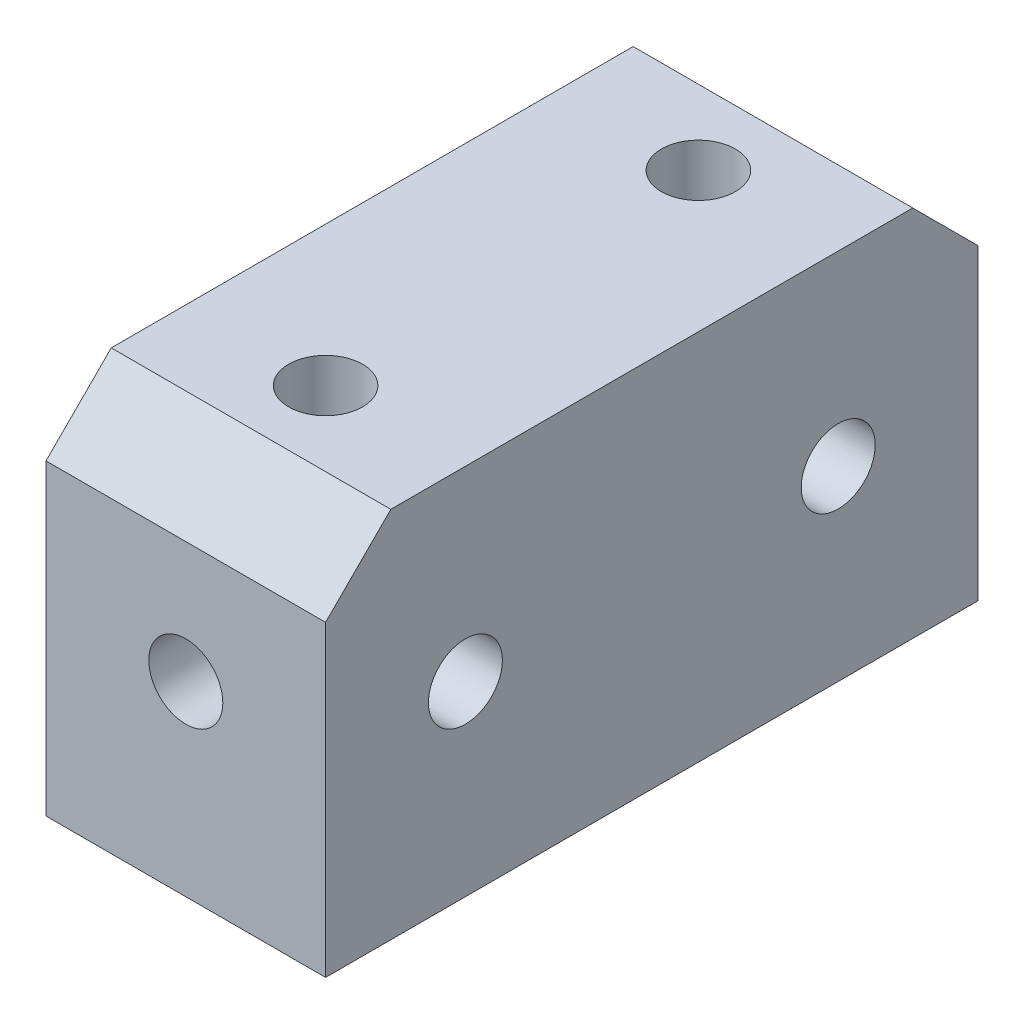
ISO-10303-21;
HEADER;
FILE_DESCRIPTION(('STEP AP214'),'2;1');
FILE_NAME('part.step','',(''),(''),'','','');
FILE_SCHEMA(('AUTOMOTIVE_DESIGN { 1 0 10303 214 1 1 1 1 }'));
ENDSEC;
DATA;
#1=APPLICATION_CONTEXT('core data for automotive mechanical design processes');
#2=APPLICATION_PROTOCOL_DEFINITION('international standard','automotive_design',2000,#1);
#3=PRODUCT_CONTEXT('',#1,'mechanical');
#4=PRODUCT('Part','Part','',(#3));
#5=PRODUCT_RELATED_PRODUCT_CATEGORY('part','',(#4));
#6=PRODUCT_DEFINITION_FORMATION('','',#4);
#7=PRODUCT_DEFINITION_CONTEXT('part definition',#1,'design');
#8=PRODUCT_DEFINITION('design','',#6,#7);
#9=PRODUCT_DEFINITION_SHAPE('','',#8);
#10=(LENGTH_UNIT() NAMED_UNIT(*) SI_UNIT(.MILLI.,.METRE.));
#11=(NAMED_UNIT(*) PLANE_ANGLE_UNIT() SI_UNIT($,.RADIAN.));
#12=(NAMED_UNIT(*) SI_UNIT($,.STERADIAN.) SOLID_ANGLE_UNIT());
#13=UNCERTAINTY_MEASURE_WITH_UNIT(LENGTH_MEASURE(1.E-05),#10,'distance_accuracy_value','');
#14=(GEOMETRIC_REPRESENTATION_CONTEXT(3) GLOBAL_UNCERTAINTY_ASSIGNED_CONTEXT((#13)) GLOBAL_UNIT_ASSIGNED_CONTEXT((#10,
#11,#12)) REPRESENTATION_CONTEXT('',''));
#15=CARTESIAN_POINT('',(0.,0.,0.));
#16=DIRECTION('',(0.,0.,1.));
#17=DIRECTION('',(1.,0.,0.));
#18=AXIS2_PLACEMENT_3D('',#15,#16,#17);
#19=CARTESIAN_POINT('',(15.,0.,0.));
#20=DIRECTION('',(-1.,0.,0.));
#21=DIRECTION('',(0.,0.,1.));
#22=AXIS2_PLACEMENT_3D('',#19,#20,#21);
#23=PLANE('',#22);
#24=DIRECTION('',(0.,1.,0.));
#25=VECTOR('',#24,1.);
#26=CARTESIAN_POINT('',(15.,20.,-35.));
#27=LINE('',#26,#25);
#28=CARTESIAN_POINT('',(15.,-20.,-35.));
#29=VERTEX_POINT('',#28);
#30=CARTESIAN_POINT('',(15.,13.,-35.));
#31=VERTEX_POINT('',#30);
#32=EDGE_CURVE('E151',#29,#31,#27,.T.);
#33=ORIENTED_EDGE('',*,*,#32,.T.);
#34=DIRECTION('',(0.,-0.707106781186549,-0.707106781186546));
#35=VECTOR('',#34,1.);
#36=CARTESIAN_POINT('',(15.,20.,-28.));
#37=LINE('',#36,#35);
#38=CARTESIAN_POINT('',(15.,20.,-28.));
#39=VERTEX_POINT('',#38);
#40=EDGE_CURVE('E46',#31,#39,#37,.F.);
#41=ORIENTED_EDGE('',*,*,#40,.T.);
#42=DIRECTION('',(0.,0.,1.));
#43=VECTOR('',#42,1.);
#44=CARTESIAN_POINT('',(15.,20.,-35.));
#45=LINE('',#44,#43);
#46=CARTESIAN_POINT('',(15.,20.,28.));
#47=VERTEX_POINT('',#46);
#48=EDGE_CURVE('E153',#39,#47,#45,.T.);
#49=ORIENTED_EDGE('',*,*,#48,.T.);
#50=DIRECTION('',(0.,0.707106781186546,-0.707106781186549));
#51=VECTOR('',#50,1.);
#52=CARTESIAN_POINT('',(15.,13.,35.));
#53=LINE('',#52,#51);
#54=CARTESIAN_POINT('',(15.,13.,35.));
#55=VERTEX_POINT('',#54);
#56=EDGE_CURVE('E53',#47,#55,#53,.F.);
#57=ORIENTED_EDGE('',*,*,#56,.T.);
#58=DIRECTION('',(0.,-1.,0.));
#59=VECTOR('',#58,1.);
#60=CARTESIAN_POINT('',(15.,20.,35.));
#61=LINE('',#60,#59);
#62=CARTESIAN_POINT('',(15.,-20.,35.));
#63=VERTEX_POINT('',#62);
#64=EDGE_CURVE('E146',#55,#63,#61,.T.);
#65=ORIENTED_EDGE('',*,*,#64,.T.);
#66=DIRECTION('',(0.,0.,-1.));
#67=VECTOR('',#66,1.);
#68=CARTESIAN_POINT('',(15.,-20.,-35.));
#69=LINE('',#68,#67);
#70=EDGE_CURVE('E148',#63,#29,#69,.T.);
#71=ORIENTED_EDGE('',*,*,#70,.T.);
#72=EDGE_LOOP('',(#33,#41,#49,#57,#65,#71));
#73=FACE_BOUND('',#72,.T.);
#74=CARTESIAN_POINT('',(15.,0.,20.));
#75=DIRECTION('',(1.,0.,0.));
#76=DIRECTION('',(0.,0.,-1.));
#77=AXIS2_PLACEMENT_3D('',#74,#75,#76);
#78=CIRCLE('',#77,3.97);
#79=CARTESIAN_POINT('',(15.,0.,16.03));
#80=VERTEX_POINT('',#79);
#81=EDGE_CURVE('E140',#80,#80,#78,.T.);
#82=ORIENTED_EDGE('',*,*,#81,.F.);
#83=EDGE_LOOP('',(#82));
#84=FACE_BOUND('',#83,.T.);
#85=CARTESIAN_POINT('',(15.,0.,-20.));
#86=DIRECTION('',(1.,0.,0.));
#87=DIRECTION('',(0.,0.,-1.));
#88=AXIS2_PLACEMENT_3D('',#85,#86,#87);
#89=CIRCLE('',#88,3.97);
#90=CARTESIAN_POINT('',(15.,0.,-23.97));
#91=VERTEX_POINT('',#90);
#92=EDGE_CURVE('E134',#91,#91,#89,.T.);
#93=ORIENTED_EDGE('',*,*,#92,.F.);
#94=EDGE_LOOP('',(#93));
#95=FACE_BOUND('',#94,.T.);
#96=ADVANCED_FACE('F38',(#73,#84,#95),#23,.F.);
#97=CARTESIAN_POINT('',(-15.,0.,0.));
#98=DIRECTION('',(-1.,0.,0.));
#99=DIRECTION('',(0.,0.,1.));
#100=AXIS2_PLACEMENT_3D('',#97,#98,#99);
#101=PLANE('',#100);
#102=CARTESIAN_POINT('',(-15.,0.,20.));
#103=DIRECTION('',(1.,0.,0.));
#104=DIRECTION('',(0.,0.,-1.));
#105=AXIS2_PLACEMENT_3D('',#102,#103,#104);
#106=CIRCLE('',#105,3.97);
#107=CARTESIAN_POINT('',(-15.,0.,16.03));
#108=VERTEX_POINT('',#107);
#109=EDGE_CURVE('E137',#108,#108,#106,.T.);
#110=ORIENTED_EDGE('',*,*,#109,.T.);
#111=EDGE_LOOP('',(#110));
#112=FACE_BOUND('',#111,.T.);
#113=DIRECTION('',(0.,0.,1.));
#114=VECTOR('',#113,1.);
#115=CARTESIAN_POINT('',(-15.,20.,-35.));
#116=LINE('',#115,#114);
#117=CARTESIAN_POINT('',(-15.,20.,-28.));
#118=VERTEX_POINT('',#117);
#119=CARTESIAN_POINT('',(-15.,20.,28.));
#120=VERTEX_POINT('',#119);
#121=EDGE_CURVE('E149',#118,#120,#116,.T.);
#122=ORIENTED_EDGE('',*,*,#121,.F.);
#123=DIRECTION('',(0.,0.707106781186549,0.707106781186546));
#124=VECTOR('',#123,1.);
#125=CARTESIAN_POINT('',(-15.,24.,-24.));
#126=LINE('',#125,#124);
#127=CARTESIAN_POINT('',(-15.,13.,-35.));
#128=VERTEX_POINT('',#127);
#129=EDGE_CURVE('E183',#118,#128,#126,.F.);
#130=ORIENTED_EDGE('',*,*,#129,.T.);
#131=DIRECTION('',(0.,1.,0.));
#132=VECTOR('',#131,1.);
#133=CARTESIAN_POINT('',(-15.,20.,-35.));
#134=LINE('',#133,#132);
#135=CARTESIAN_POINT('',(-15.,-20.,-35.));
#136=VERTEX_POINT('',#135);
#137=EDGE_CURVE('E159',#136,#128,#134,.T.);
#138=ORIENTED_EDGE('',*,*,#137,.F.);
#139=DIRECTION('',(0.,0.,-1.));
#140=VECTOR('',#139,1.);
#141=CARTESIAN_POINT('',(-15.,-20.,-35.));
#142=LINE('',#141,#140);
#143=CARTESIAN_POINT('',(-15.,-20.,35.));
#144=VERTEX_POINT('',#143);
#145=EDGE_CURVE('E157',#144,#136,#142,.T.);
#146=ORIENTED_EDGE('',*,*,#145,.F.);
#147=DIRECTION('',(0.,-1.,0.));
#148=VECTOR('',#147,1.);
#149=CARTESIAN_POINT('',(-15.,20.,35.));
#150=LINE('',#149,#148);
#151=CARTESIAN_POINT('',(-15.,13.,35.));
#152=VERTEX_POINT('',#151);
#153=EDGE_CURVE('E143',#152,#144,#150,.T.);
#154=ORIENTED_EDGE('',*,*,#153,.F.);
#155=DIRECTION('',(0.,-0.707106781186546,0.707106781186549));
#156=VECTOR('',#155,1.);
#157=CARTESIAN_POINT('',(-15.,24.,23.9999999999999));
#158=LINE('',#157,#156);
#159=EDGE_CURVE('E181',#152,#120,#158,.F.);
#160=ORIENTED_EDGE('',*,*,#159,.T.);
#161=EDGE_LOOP('',(#122,#130,#138,#146,#154,#160));
#162=FACE_BOUND('',#161,.T.);
#163=CARTESIAN_POINT('',(-15.,0.,-20.));
#164=DIRECTION('',(1.,0.,0.));
#165=DIRECTION('',(0.,0.,-1.));
#166=AXIS2_PLACEMENT_3D('',#163,#164,#165);
#167=CIRCLE('',#166,3.97);
#168=CARTESIAN_POINT('',(-15.,0.,-23.97));
#169=VERTEX_POINT('',#168);
#170=EDGE_CURVE('E130',#169,#169,#167,.T.);
#171=ORIENTED_EDGE('',*,*,#170,.T.);
#172=EDGE_LOOP('',(#171));
#173=FACE_BOUND('',#172,.T.);
#174=ADVANCED_FACE('F198',(#112,#162,#173),#101,.T.);
#175=CARTESIAN_POINT('',(15.,20.,35.));
#176=DIRECTION('',(0.,0.,-1.));
#177=DIRECTION('',(-1.,0.,0.));
#178=AXIS2_PLACEMENT_3D('',#175,#176,#177);
#179=PLANE('',#178);
#180=CARTESIAN_POINT('',(0.,0.,35.));
#181=DIRECTION('',(0.,0.,1.));
#182=DIRECTION('',(1.,0.,0.));
#183=AXIS2_PLACEMENT_3D('',#180,#181,#182);
#184=CIRCLE('',#183,3.97);
#185=CARTESIAN_POINT('',(3.97,0.,35.));
#186=VERTEX_POINT('',#185);
#187=EDGE_CURVE('E127',#186,#186,#184,.T.);
#188=ORIENTED_EDGE('',*,*,#187,.F.);
#189=EDGE_LOOP('',(#188));
#190=FACE_BOUND('',#189,.T.);
#191=ORIENTED_EDGE('',*,*,#64,.F.);
#192=DIRECTION('',(-1.,0.,0.));
#193=VECTOR('',#192,1.);
#194=CARTESIAN_POINT('',(15.,13.,35.));
#195=LINE('',#194,#193);
#196=EDGE_CURVE('E11',#55,#152,#195,.T.);
#197=ORIENTED_EDGE('',*,*,#196,.T.);
#198=ORIENTED_EDGE('',*,*,#153,.T.);
#199=DIRECTION('',(-1.,0.,0.));
#200=VECTOR('',#199,1.);
#201=CARTESIAN_POINT('',(15.,-20.,35.));
#202=LINE('',#201,#200);
#203=EDGE_CURVE('E165',#63,#144,#202,.T.);
#204=ORIENTED_EDGE('',*,*,#203,.F.);
#205=EDGE_LOOP('',(#191,#197,#198,#204));
#206=FACE_BOUND('',#205,.T.);
#207=ADVANCED_FACE('F209',(#190,#206),#179,.F.);
#208=CARTESIAN_POINT('',(15.,-20.,-35.));
#209=DIRECTION('',(0.,1.,0.));
#210=DIRECTION('',(0.,0.,1.));
#211=AXIS2_PLACEMENT_3D('',#208,#209,#210);
#212=PLANE('',#211);
#213=ORIENTED_EDGE('',*,*,#145,.T.);
#214=DIRECTION('',(-1.,0.,0.));
#215=VECTOR('',#214,1.);
#216=CARTESIAN_POINT('',(15.,-20.,-35.));
#217=LINE('',#216,#215);
#218=EDGE_CURVE('E155',#29,#136,#217,.T.);
#219=ORIENTED_EDGE('',*,*,#218,.F.);
#220=ORIENTED_EDGE('',*,*,#70,.F.);
#221=ORIENTED_EDGE('',*,*,#203,.T.);
#222=EDGE_LOOP('',(#213,#219,#220,#221));
#223=FACE_BOUND('',#222,.T.);
#224=ADVANCED_FACE('F205',(#223),#212,.F.);
#225=CARTESIAN_POINT('',(15.,20.,-35.));
#226=DIRECTION('',(0.,0.,1.));
#227=DIRECTION('',(0.,-1.,0.));
#228=AXIS2_PLACEMENT_3D('',#225,#226,#227);
#229=PLANE('',#228);
#230=ORIENTED_EDGE('',*,*,#137,.T.);
#231=DIRECTION('',(1.,0.,0.));
#232=VECTOR('',#231,1.);
#233=CARTESIAN_POINT('',(15.,13.,-35.));
#234=LINE('',#233,#232);
#235=EDGE_CURVE('E61',#128,#31,#234,.T.);
#236=ORIENTED_EDGE('',*,*,#235,.T.);
#237=ORIENTED_EDGE('',*,*,#32,.F.);
#238=ORIENTED_EDGE('',*,*,#218,.T.);
#239=EDGE_LOOP('',(#230,#236,#237,#238));
#240=FACE_BOUND('',#239,.T.);
#241=ADVANCED_FACE('F201',(#240),#229,.F.);
#242=CARTESIAN_POINT('',(15.,20.,-35.));
#243=DIRECTION('',(0.,-1.,0.));
#244=DIRECTION('',(0.,0.,-1.));
#245=AXIS2_PLACEMENT_3D('',#242,#243,#244);
#246=PLANE('',#245);
#247=CARTESIAN_POINT('',(0.,20.,-20.));
#248=DIRECTION('',(0.,1.,0.));
#249=DIRECTION('',(0.,0.,1.));
#250=AXIS2_PLACEMENT_3D('',#247,#248,#249);
#251=CIRCLE('',#250,3.97);
#252=CARTESIAN_POINT('',(0.,20.,-16.03));
#253=VERTEX_POINT('',#252);
#254=EDGE_CURVE('E121',#253,#253,#251,.T.);
#255=ORIENTED_EDGE('',*,*,#254,.F.);
#256=EDGE_LOOP('',(#255));
#257=FACE_BOUND('',#256,.T.);
#258=CARTESIAN_POINT('',(0.,20.,20.));
#259=DIRECTION('',(0.,1.,0.));
#260=DIRECTION('',(0.,0.,1.));
#261=AXIS2_PLACEMENT_3D('',#258,#259,#260);
#262=CIRCLE('',#261,3.97);
#263=CARTESIAN_POINT('',(0.,20.,23.97));
#264=VERTEX_POINT('',#263);
#265=EDGE_CURVE('E261',#264,#264,#262,.T.);
#266=ORIENTED_EDGE('',*,*,#265,.F.);
#267=EDGE_LOOP('',(#266));
#268=FACE_BOUND('',#267,.T.);
#269=ORIENTED_EDGE('',*,*,#48,.F.);
#270=DIRECTION('',(-1.,0.,0.));
#271=VECTOR('',#270,1.);
#272=CARTESIAN_POINT('',(15.,20.,-28.));
#273=LINE('',#272,#271);
#274=EDGE_CURVE('E178',#39,#118,#273,.T.);
#275=ORIENTED_EDGE('',*,*,#274,.T.);
#276=ORIENTED_EDGE('',*,*,#121,.T.);
#277=DIRECTION('',(1.,0.,0.));
#278=VECTOR('',#277,1.);
#279=CARTESIAN_POINT('',(15.,20.,28.));
#280=LINE('',#279,#278);
#281=EDGE_CURVE('E176',#120,#47,#280,.T.);
#282=ORIENTED_EDGE('',*,*,#281,.T.);
#283=EDGE_LOOP('',(#269,#275,#276,#282));
#284=FACE_BOUND('',#283,.T.);
#285=ADVANCED_FACE('F192',(#257,#268,#284),#246,.F.);
#286=CARTESIAN_POINT('',(15.,0.,20.));
#287=DIRECTION('',(-1.,0.,0.));
#288=DIRECTION('',(0.,0.,1.));
#289=AXIS2_PLACEMENT_3D('',#286,#287,#288);
#290=CYLINDRICAL_SURFACE('',#289,3.97);
#291=CARTESIAN_POINT('',(0.,0.,20.));
#292=DIRECTION('',(-0.707106781186547,0.707106781186547,0.));
#293=DIRECTION('',(-0.707106781186547,-0.707106781186547,0.));
#294=AXIS2_PLACEMENT_3D('',#291,#292,#293);
#295=ELLIPSE('',#294,5.61442784262119,3.97);
#296=CARTESIAN_POINT('',(0.,0.,16.03));
#297=VERTEX_POINT('',#296);
#298=CARTESIAN_POINT('',(2.80721392131059,2.80721392131059,22.8072139213106));
#299=VERTEX_POINT('',#298);
#300=EDGE_CURVE('E115',#297,#299,#295,.F.);
#301=ORIENTED_EDGE('',*,*,#300,.F.);
#302=CARTESIAN_POINT('',(0.,0.,20.));
#303=DIRECTION('',(-0.707106781186547,-0.707106781186547,0.));
#304=DIRECTION('',(-0.707106781186547,0.707106781186547,0.));
#305=AXIS2_PLACEMENT_3D('',#302,#303,#304);
#306=ELLIPSE('',#305,5.61442784262119,3.97);
#307=CARTESIAN_POINT('',(-2.8072139213106,2.80721392131059,22.8072139213106));
#308=VERTEX_POINT('',#307);
#309=EDGE_CURVE('E111',#308,#297,#306,.T.);
#310=ORIENTED_EDGE('',*,*,#309,.F.);
#311=CARTESIAN_POINT('',(0.,0.,20.));
#312=DIRECTION('',(-0.707106781186548,0.,-0.707106781186547));
#313=DIRECTION('',(-0.707106781186548,0.,0.707106781186547));
#314=AXIS2_PLACEMENT_3D('',#311,#312,#313);
#315=ELLIPSE('',#314,5.61442784262119,3.97);
#316=CARTESIAN_POINT('',(0.,-3.97,20.));
#317=VERTEX_POINT('',#316);
#318=EDGE_CURVE('E168',#317,#308,#315,.T.);
#319=ORIENTED_EDGE('',*,*,#318,.F.);
#320=CARTESIAN_POINT('',(0.,0.,20.));
#321=DIRECTION('',(-0.707106781186548,0.,0.707106781186547));
#322=DIRECTION('',(-0.707106781186548,0.,-0.707106781186547));
#323=AXIS2_PLACEMENT_3D('',#320,#321,#322);
#324=ELLIPSE('',#323,5.61442784262119,3.97);
#325=EDGE_CURVE('E126',#299,#317,#324,.F.);
#326=ORIENTED_EDGE('',*,*,#325,.F.);
#327=EDGE_LOOP('',(#301,#310,#319,#326));
#328=FACE_BOUND('',#327,.T.);
#329=ORIENTED_EDGE('',*,*,#81,.T.);
#330=EDGE_LOOP('',(#329));
#331=FACE_BOUND('',#330,.T.);
#332=ORIENTED_EDGE('',*,*,#109,.F.);
#333=EDGE_LOOP('',(#332));
#334=FACE_BOUND('',#333,.T.);
#335=ADVANCED_FACE('F124',(#328,#331,#334),#290,.F.);
#336=CARTESIAN_POINT('',(15.,0.,-20.));
#337=DIRECTION('',(-1.,0.,0.));
#338=DIRECTION('',(0.,0.,1.));
#339=AXIS2_PLACEMENT_3D('',#336,#337,#338);
#340=CYLINDRICAL_SURFACE('',#339,3.97);
#341=CARTESIAN_POINT('',(0.,0.,-20.));
#342=DIRECTION('',(-0.707106781186547,0.707106781186547,0.));
#343=DIRECTION('',(-0.707106781186547,-0.707106781186547,0.));
#344=AXIS2_PLACEMENT_3D('',#341,#342,#343);
#345=ELLIPSE('',#344,5.61442784262119,3.97);
#346=CARTESIAN_POINT('',(0.,0.,-23.97));
#347=VERTEX_POINT('',#346);
#348=CARTESIAN_POINT('',(0.,0.,-16.03));
#349=VERTEX_POINT('',#348);
#350=EDGE_CURVE('E174',#347,#349,#345,.F.);
#351=ORIENTED_EDGE('',*,*,#350,.F.);
#352=CARTESIAN_POINT('',(0.,0.,-20.));
#353=DIRECTION('',(-0.707106781186547,-0.707106781186547,0.));
#354=DIRECTION('',(-0.707106781186547,0.707106781186547,0.));
#355=AXIS2_PLACEMENT_3D('',#352,#353,#354);
#356=ELLIPSE('',#355,5.61442784262119,3.97);
#357=EDGE_CURVE('E172',#349,#347,#356,.T.);
#358=ORIENTED_EDGE('',*,*,#357,.F.);
#359=EDGE_LOOP('',(#351,#358));
#360=FACE_BOUND('',#359,.T.);
#361=ORIENTED_EDGE('',*,*,#92,.T.);
#362=EDGE_LOOP('',(#361));
#363=FACE_BOUND('',#362,.T.);
#364=ORIENTED_EDGE('',*,*,#170,.F.);
#365=EDGE_LOOP('',(#364));
#366=FACE_BOUND('',#365,.T.);
#367=ADVANCED_FACE('F242',(#360,#363,#366),#340,.F.);
#368=CARTESIAN_POINT('',(0.,0.,20.));
#369=DIRECTION('',(0.,0.,1.));
#370=DIRECTION('',(1.,0.,0.));
#371=AXIS2_PLACEMENT_3D('',#368,#369,#370);
#372=CYLINDRICAL_SURFACE('',#371,3.97);
#373=ORIENTED_EDGE('',*,*,#318,.T.);
#374=CARTESIAN_POINT('',(0.,0.,20.));
#375=DIRECTION('',(0.,-0.707106781186548,0.707106781186547));
#376=DIRECTION('',(0.,0.707106781186547,0.707106781186547));
#377=AXIS2_PLACEMENT_3D('',#374,#375,#376);
#378=ELLIPSE('',#377,5.61442784262119,3.97);
#379=EDGE_CURVE('E117',#308,#299,#378,.F.);
#380=ORIENTED_EDGE('',*,*,#379,.T.);
#381=ORIENTED_EDGE('',*,*,#325,.T.);
#382=EDGE_LOOP('',(#373,#380,#381));
#383=FACE_BOUND('',#382,.T.);
#384=ORIENTED_EDGE('',*,*,#187,.T.);
#385=EDGE_LOOP('',(#384));
#386=FACE_BOUND('',#385,.T.);
#387=ADVANCED_FACE('F240',(#383,#386),#372,.F.);
#388=CARTESIAN_POINT('',(0.,0.,20.));
#389=DIRECTION('',(0.,1.,0.));
#390=DIRECTION('',(0.,0.,1.));
#391=AXIS2_PLACEMENT_3D('',#388,#389,#390);
#392=CYLINDRICAL_SURFACE('',#391,3.97);
#393=ORIENTED_EDGE('',*,*,#300,.T.);
#394=ORIENTED_EDGE('',*,*,#379,.F.);
#395=ORIENTED_EDGE('',*,*,#309,.T.);
#396=EDGE_LOOP('',(#393,#394,#395));
#397=FACE_BOUND('',#396,.T.);
#398=ORIENTED_EDGE('',*,*,#265,.T.);
#399=EDGE_LOOP('',(#398));
#400=FACE_BOUND('',#399,.T.);
#401=ADVANCED_FACE('F113',(#397,#400),#392,.F.);
#402=CARTESIAN_POINT('',(0.,0.,-20.));
#403=DIRECTION('',(0.,1.,0.));
#404=DIRECTION('',(0.,0.,1.));
#405=AXIS2_PLACEMENT_3D('',#402,#403,#404);
#406=CYLINDRICAL_SURFACE('',#405,3.97);
#407=ORIENTED_EDGE('',*,*,#350,.T.);
#408=ORIENTED_EDGE('',*,*,#357,.T.);
#409=EDGE_LOOP('',(#407,#408));
#410=FACE_BOUND('',#409,.T.);
#411=ORIENTED_EDGE('',*,*,#254,.T.);
#412=EDGE_LOOP('',(#411));
#413=FACE_BOUND('',#412,.T.);
#414=ADVANCED_FACE('F216',(#410,#413),#406,.F.);
#415=CARTESIAN_POINT('',(15.,20.,-28.));
#416=DIRECTION('',(0.,-0.707106781186546,0.707106781186548));
#417=DIRECTION('',(-1.,0.,0.));
#418=AXIS2_PLACEMENT_3D('',#415,#416,#417);
#419=PLANE('',#418);
#420=ORIENTED_EDGE('',*,*,#40,.F.);
#421=ORIENTED_EDGE('',*,*,#235,.F.);
#422=ORIENTED_EDGE('',*,*,#129,.F.);
#423=ORIENTED_EDGE('',*,*,#274,.F.);
#424=EDGE_LOOP('',(#420,#421,#422,#423));
#425=FACE_BOUND('',#424,.T.);
#426=ADVANCED_FACE('F195',(#425),#419,.F.);
#427=CARTESIAN_POINT('',(15.,13.,35.));
#428=DIRECTION('',(0.,-0.707106781186549,-0.707106781186546));
#429=DIRECTION('',(-1.,0.,0.));
#430=AXIS2_PLACEMENT_3D('',#427,#428,#429);
#431=PLANE('',#430);
#432=ORIENTED_EDGE('',*,*,#56,.F.);
#433=ORIENTED_EDGE('',*,*,#281,.F.);
#434=ORIENTED_EDGE('',*,*,#159,.F.);
#435=ORIENTED_EDGE('',*,*,#196,.F.);
#436=EDGE_LOOP('',(#432,#433,#434,#435));
#437=FACE_BOUND('',#436,.T.);
#438=ADVANCED_FACE('F40',(#437),#431,.F.);
#439=CLOSED_SHELL('',(#96,#174,#207,#224,#241,#285,#335,#367,#387,#401,#414,#426,#438));
#440=MANIFOLD_SOLID_BREP('B2',#439);
#441=ADVANCED_BREP_SHAPE_REPRESENTATION('',(#18,#440),#14);
#442=SHAPE_DEFINITION_REPRESENTATION(#9,#441);
ENDSEC;
END-ISO-10303-21;
